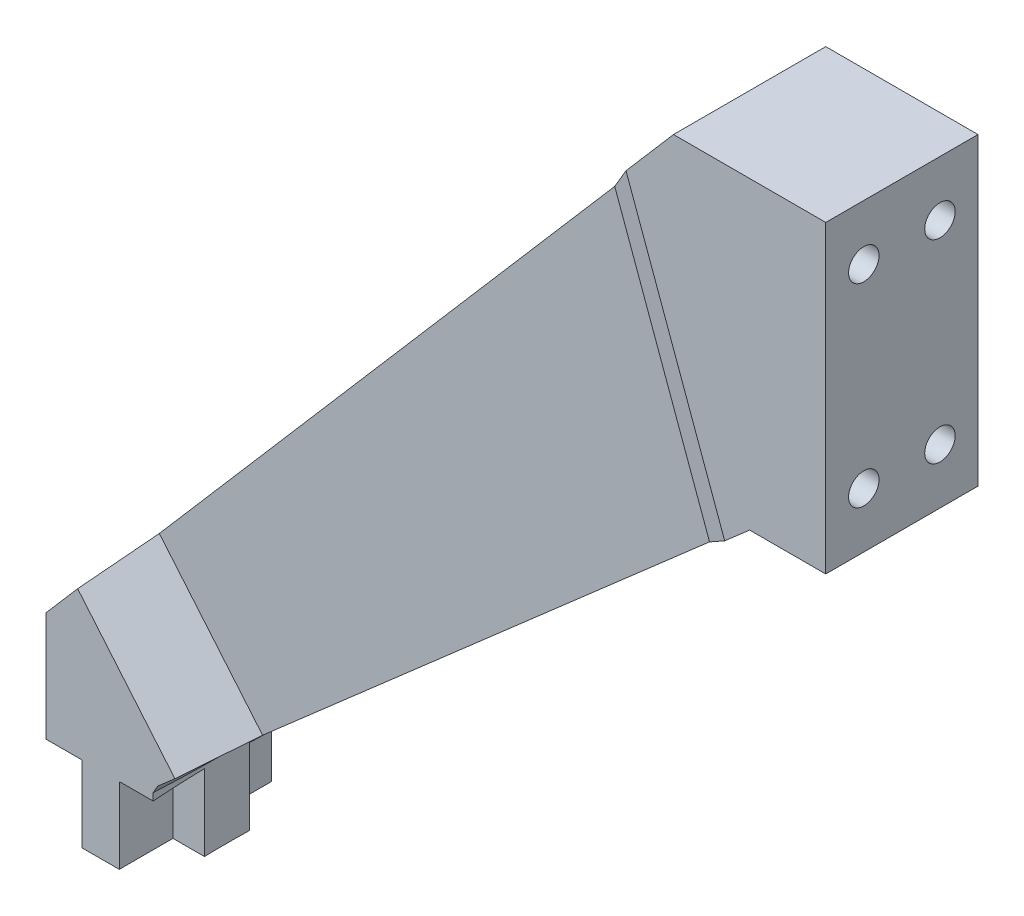
ISO-10303-21;
HEADER;
FILE_DESCRIPTION(('STEP AP214'),'2;1');
FILE_NAME('part.step','',(''),(''),'','','');
FILE_SCHEMA(('AUTOMOTIVE_DESIGN { 1 0 10303 214 1 1 1 1 }'));
ENDSEC;
DATA;
#1=APPLICATION_CONTEXT('core data for automotive mechanical design processes');
#2=APPLICATION_PROTOCOL_DEFINITION('international standard','automotive_design',2000,#1);
#3=PRODUCT_CONTEXT('',#1,'mechanical');
#4=PRODUCT('Part','Part','',(#3));
#5=PRODUCT_RELATED_PRODUCT_CATEGORY('part','',(#4));
#6=PRODUCT_DEFINITION_FORMATION('','',#4);
#7=PRODUCT_DEFINITION_CONTEXT('part definition',#1,'design');
#8=PRODUCT_DEFINITION('design','',#6,#7);
#9=PRODUCT_DEFINITION_SHAPE('','',#8);
#10=(LENGTH_UNIT() NAMED_UNIT(*) SI_UNIT(.MILLI.,.METRE.));
#11=(NAMED_UNIT(*) PLANE_ANGLE_UNIT() SI_UNIT($,.RADIAN.));
#12=(NAMED_UNIT(*) SI_UNIT($,.STERADIAN.) SOLID_ANGLE_UNIT());
#13=UNCERTAINTY_MEASURE_WITH_UNIT(LENGTH_MEASURE(1.E-05),#10,'distance_accuracy_value','');
#14=(GEOMETRIC_REPRESENTATION_CONTEXT(3) GLOBAL_UNCERTAINTY_ASSIGNED_CONTEXT((#13)) GLOBAL_UNIT_ASSIGNED_CONTEXT((#10,
#11,#12)) REPRESENTATION_CONTEXT('',''));
#15=CARTESIAN_POINT('',(0.,0.,0.));
#16=DIRECTION('',(0.,0.,1.));
#17=DIRECTION('',(1.,0.,0.));
#18=AXIS2_PLACEMENT_3D('',#15,#16,#17);
#19=CARTESIAN_POINT('',(-102.75,24.,10.));
#20=DIRECTION('',(0.757443598204121,-0.652900601576989,0.));
#21=DIRECTION('',(0.652900601576989,0.757443598204121,0.));
#22=AXIS2_PLACEMENT_3D('',#19,#20,#21);
#23=PLANE('',#22);
#24=CARTESIAN_POINT('',(52.25,203.818731117825,0.));
#25=DIRECTION('',(0.757443598204121,-0.652900601576989,0.));
#26=DIRECTION('',(0.652900601576989,0.757443598204121,0.));
#27=AXIS2_PLACEMENT_3D('',#24,#25,#26);
#28=ELLIPSE('',#27,237.402139966818,155.);
#29=CARTESIAN_POINT('',(-102.42708298258,24.3746227634115,10.));
#30=VERTEX_POINT('',#29);
#31=CARTESIAN_POINT('',(-102.42708298258,24.3746227634115,-10.));
#32=VERTEX_POINT('',#31);
#33=EDGE_CURVE('E433',#30,#32,#28,.T.);
#34=ORIENTED_EDGE('',*,*,#33,.F.);
#35=DIRECTION('',(-0.652900601576989,-0.757443598204121,0.));
#36=VECTOR('',#35,1.);
#37=CARTESIAN_POINT('',(-102.75,24.,10.));
#38=LINE('',#37,#36);
#39=CARTESIAN_POINT('',(-98.2695065130106,29.1979138942717,10.));
#40=VERTEX_POINT('',#39);
#41=EDGE_CURVE('E415',#40,#30,#38,.T.);
#42=ORIENTED_EDGE('',*,*,#41,.F.);
#43=DIRECTION('',(-0.567259398931517,-0.658089453745325,0.495111144282809));
#44=VECTOR('',#43,1.);
#45=CARTESIAN_POINT('',(-101.65167402658,25.2741908573818,12.9519983819634));
#46=LINE('',#45,#44);
#47=CARTESIAN_POINT('',(-92.5408998609303,35.8437898894344,5.));
#48=VERTEX_POINT('',#47);
#49=EDGE_CURVE('E299',#40,#48,#46,.F.);
#50=ORIENTED_EDGE('',*,*,#49,.T.);
#51=DIRECTION('',(-0.652900601576989,-0.757443598204121,0.));
#52=VECTOR('',#51,1.);
#53=CARTESIAN_POINT('',(-70.8186618005813,61.0442110833136,5.));
#54=LINE('',#53,#52);
#55=CARTESIAN_POINT('',(-32.7202666450974,105.242953499343,5.));
#56=VERTEX_POINT('',#55);
#57=EDGE_CURVE('E389',#56,#48,#54,.T.);
#58=ORIENTED_EDGE('',*,*,#57,.F.);
#59=DIRECTION('',(0.583085827464092,0.676450023402452,0.449918085488167));
#60=VECTOR('',#59,1.);
#61=CARTESIAN_POINT('',(-87.2624370361734,41.9674446468562,-37.0855862462777));
#62=LINE('',#61,#60);
#63=CARTESIAN_POINT('',(-26.2403556760659,112.760433294232,10.));
#64=VERTEX_POINT('',#63);
#65=EDGE_CURVE('E288',#56,#64,#62,.T.);
#66=ORIENTED_EDGE('',*,*,#65,.T.);
#67=CARTESIAN_POINT('',(-20.,120.,10.));
#68=VERTEX_POINT('',#67);
#69=EDGE_CURVE('E416',#68,#64,#38,.T.);
#70=ORIENTED_EDGE('',*,*,#69,.F.);
#71=DIRECTION('',(0.,0.,-1.));
#72=VECTOR('',#71,1.);
#73=CARTESIAN_POINT('',(-20.,120.,10.));
#74=LINE('',#73,#72);
#75=CARTESIAN_POINT('',(-20.,120.,-10.));
#76=VERTEX_POINT('',#75);
#77=EDGE_CURVE('E253',#68,#76,#74,.T.);
#78=ORIENTED_EDGE('',*,*,#77,.T.);
#79=DIRECTION('',(-0.652900601576989,-0.757443598204121,0.));
#80=VECTOR('',#79,1.);
#81=CARTESIAN_POINT('',(-102.75,24.,-10.));
#82=LINE('',#81,#80);
#83=CARTESIAN_POINT('',(-26.2403556760659,112.760433294232,-10.));
#84=VERTEX_POINT('',#83);
#85=EDGE_CURVE('E428',#76,#84,#82,.T.);
#86=ORIENTED_EDGE('',*,*,#85,.T.);
#87=DIRECTION('',(0.583085827464092,0.676450023402452,-0.449918085488167));
#88=VECTOR('',#87,1.);
#89=CARTESIAN_POINT('',(-92.509254219532,35.8805026577031,41.1341119192644));
#90=LINE('',#89,#88);
#91=CARTESIAN_POINT('',(-32.7202666450974,105.242953499343,-5.));
#92=VERTEX_POINT('',#91);
#93=EDGE_CURVE('E312',#84,#92,#90,.F.);
#94=ORIENTED_EDGE('',*,*,#93,.T.);
#95=DIRECTION('',(-0.652900601576989,-0.757443598204121,0.));
#96=VECTOR('',#95,1.);
#97=CARTESIAN_POINT('',(-70.8186618005813,61.0442110833136,-5.));
#98=LINE('',#97,#96);
#99=CARTESIAN_POINT('',(-92.5408998609303,35.8437898894344,-5.));
#100=VERTEX_POINT('',#99);
#101=EDGE_CURVE('E473',#92,#100,#98,.T.);
#102=ORIENTED_EDGE('',*,*,#101,.T.);
#103=DIRECTION('',(-0.567259398931517,-0.658089453745325,-0.495111144282809));
#104=VECTOR('',#103,1.);
#105=CARTESIAN_POINT('',(-96.0345450243765,31.7907393070677,-8.04929747810276));
#106=LINE('',#105,#104);
#107=CARTESIAN_POINT('',(-98.2695065130106,29.1979138942717,-10.));
#108=VERTEX_POINT('',#107);
#109=EDGE_CURVE('E317',#100,#108,#106,.T.);
#110=ORIENTED_EDGE('',*,*,#109,.T.);
#111=EDGE_CURVE('E427',#108,#32,#82,.T.);
#112=ORIENTED_EDGE('',*,*,#111,.T.);
#113=EDGE_LOOP('',(#34,#42,#50,#58,#66,#70,#78,#86,#94,#102,#110,#112));
#114=FACE_BOUND('',#113,.T.);
#115=ADVANCED_FACE('F43',(#114),#23,.F.);
#116=CARTESIAN_POINT('',(0.,0.,10.));
#117=DIRECTION('',(0.,0.,-1.));
#118=DIRECTION('',(-1.,0.,0.));
#119=AXIS2_PLACEMENT_3D('',#116,#117,#118);
#120=PLANE('',#119);
#121=DIRECTION('',(0.,-1.,0.));
#122=VECTOR('',#121,1.);
#123=CARTESIAN_POINT('',(-88.3546420416717,12.,10.));
#124=LINE('',#123,#122);
#125=CARTESIAN_POINT('',(-88.3546420416717,9.99999999999999,10.));
#126=VERTEX_POINT('',#125);
#127=CARTESIAN_POINT('',(-88.3546420416717,10.9527292634325,10.));
#128=VERTEX_POINT('',#127);
#129=EDGE_CURVE('E58',#126,#128,#124,.F.);
#130=ORIENTED_EDGE('',*,*,#129,.T.);
#131=DIRECTION('',(0.500000000000007,0.866025403784435,0.));
#132=VECTOR('',#131,1.);
#133=CARTESIAN_POINT('',(-87.75,12.,10.));
#134=LINE('',#133,#132);
#135=CARTESIAN_POINT('',(-87.75,12.,10.));
#136=VERTEX_POINT('',#135);
#137=EDGE_CURVE('E244',#128,#136,#134,.T.);
#138=ORIENTED_EDGE('',*,*,#137,.T.);
#139=DIRECTION('',(0.752726607938879,0.658333239097669,0.));
#140=VECTOR('',#139,1.);
#141=CARTESIAN_POINT('',(-87.75,12.,10.));
#142=LINE('',#141,#140);
#143=CARTESIAN_POINT('',(-85.4942105824559,13.9729090725787,10.));
#144=VERTEX_POINT('',#143);
#145=EDGE_CURVE('E252',#136,#144,#142,.T.);
#146=ORIENTED_EDGE('',*,*,#145,.T.);
#147=DIRECTION('',(0.642787609686533,-0.766044443118983,0.));
#148=VECTOR('',#147,1.);
#149=CARTESIAN_POINT('',(-43.2897476321817,-36.3244112719206,10.));
#150=LINE('',#149,#148);
#151=EDGE_CURVE('E296',#144,#40,#150,.F.);
#152=ORIENTED_EDGE('',*,*,#151,.T.);
#153=ORIENTED_EDGE('',*,*,#41,.T.);
#154=DIRECTION('',(0.,1.,0.));
#155=VECTOR('',#154,1.);
#156=CARTESIAN_POINT('',(-102.42708298258,0.,10.));
#157=LINE('',#156,#155);
#158=CARTESIAN_POINT('',(-102.42708298258,9.99999999999999,10.));
#159=VERTEX_POINT('',#158);
#160=EDGE_CURVE('E506',#159,#30,#157,.T.);
#161=ORIENTED_EDGE('',*,*,#160,.F.);
#162=DIRECTION('',(-1.,0.,0.));
#163=VECTOR('',#162,1.);
#164=CARTESIAN_POINT('',(0.,10.,10.));
#165=LINE('',#164,#163);
#166=CARTESIAN_POINT('',(-97.7,9.99999999999999,10.));
#167=VERTEX_POINT('',#166);
#168=EDGE_CURVE('E400',#167,#159,#165,.T.);
#169=ORIENTED_EDGE('',*,*,#168,.F.);
#170=DIRECTION('',(0.,-1.,0.));
#171=VECTOR('',#170,1.);
#172=CARTESIAN_POINT('',(-97.7,9.99999999999999,10.));
#173=LINE('',#172,#171);
#174=CARTESIAN_POINT('',(-97.7,0.,10.));
#175=VERTEX_POINT('',#174);
#176=EDGE_CURVE('E408',#167,#175,#173,.T.);
#177=ORIENTED_EDGE('',*,*,#176,.T.);
#178=DIRECTION('',(1.,0.,0.));
#179=VECTOR('',#178,1.);
#180=CARTESIAN_POINT('',(-87.75,0.,10.));
#181=LINE('',#180,#179);
#182=CARTESIAN_POINT('',(-92.8,0.,10.));
#183=VERTEX_POINT('',#182);
#184=EDGE_CURVE('E418',#175,#183,#181,.T.);
#185=ORIENTED_EDGE('',*,*,#184,.T.);
#186=DIRECTION('',(0.,-1.,0.));
#187=VECTOR('',#186,1.);
#188=CARTESIAN_POINT('',(-92.8,9.99999999999999,10.));
#189=LINE('',#188,#187);
#190=CARTESIAN_POINT('',(-92.8,9.99999999999999,10.));
#191=VERTEX_POINT('',#190);
#192=EDGE_CURVE('E344',#191,#183,#189,.T.);
#193=ORIENTED_EDGE('',*,*,#192,.F.);
#194=DIRECTION('',(-1.,0.,0.));
#195=VECTOR('',#194,1.);
#196=CARTESIAN_POINT('',(0.,10.,10.));
#197=LINE('',#196,#195);
#198=EDGE_CURVE('E348',#126,#191,#197,.T.);
#199=ORIENTED_EDGE('',*,*,#198,.F.);
#200=EDGE_LOOP('',(#130,#138,#146,#152,#153,#161,#169,#177,#185,#193,#199));
#201=FACE_BOUND('',#200,.T.);
#202=ADVANCED_FACE('F484',(#201),#120,.F.);
#203=CARTESIAN_POINT('',(-87.75,0.,10.));
#204=DIRECTION('',(0.,1.,0.));
#205=DIRECTION('',(-1.,0.,0.));
#206=AXIS2_PLACEMENT_3D('',#203,#204,#205);
#207=PLANE('',#206);
#208=DIRECTION('',(-1.,0.,0.));
#209=VECTOR('',#208,1.);
#210=CARTESIAN_POINT('',(0.,0.,-2.94999999999999));
#211=LINE('',#210,#209);
#212=CARTESIAN_POINT('',(-88.6699779188501,0.,-2.95));
#213=VERTEX_POINT('',#212);
#214=CARTESIAN_POINT('',(-92.8,0.,-2.95));
#215=VERTEX_POINT('',#214);
#216=EDGE_CURVE('E368',#213,#215,#211,.T.);
#217=ORIENTED_EDGE('',*,*,#216,.F.);
#218=CARTESIAN_POINT('',(56.25,0.,0.));
#219=DIRECTION('',(0.,-1.,0.));
#220=DIRECTION('',(1.,0.,0.));
#221=AXIS2_PLACEMENT_3D('',#218,#219,#220);
#222=CIRCLE('',#221,144.95);
#223=CARTESIAN_POINT('',(-88.6699779188501,0.,2.95));
#224=VERTEX_POINT('',#223);
#225=EDGE_CURVE('E338',#224,#213,#222,.T.);
#226=ORIENTED_EDGE('',*,*,#225,.F.);
#227=DIRECTION('',(-1.,0.,0.));
#228=VECTOR('',#227,1.);
#229=CARTESIAN_POINT('',(0.,0.,2.95000000000001));
#230=LINE('',#229,#228);
#231=CARTESIAN_POINT('',(-92.8,0.,2.94999999999999));
#232=VERTEX_POINT('',#231);
#233=EDGE_CURVE('E337',#224,#232,#230,.T.);
#234=ORIENTED_EDGE('',*,*,#233,.T.);
#235=DIRECTION('',(0.,0.,-1.));
#236=VECTOR('',#235,1.);
#237=CARTESIAN_POINT('',(-92.8,0.,0.));
#238=LINE('',#237,#236);
#239=EDGE_CURVE('E352',#183,#232,#238,.T.);
#240=ORIENTED_EDGE('',*,*,#239,.F.);
#241=ORIENTED_EDGE('',*,*,#184,.F.);
#242=DIRECTION('',(0.,0.,-1.));
#243=VECTOR('',#242,1.);
#244=CARTESIAN_POINT('',(-97.7,0.,0.));
#245=LINE('',#244,#243);
#246=CARTESIAN_POINT('',(-97.7,0.,2.94999999999999));
#247=VERTEX_POINT('',#246);
#248=EDGE_CURVE('E398',#175,#247,#245,.T.);
#249=ORIENTED_EDGE('',*,*,#248,.T.);
#250=DIRECTION('',(-1.,0.,0.));
#251=VECTOR('',#250,1.);
#252=CARTESIAN_POINT('',(0.,0.,2.95000000000001));
#253=LINE('',#252,#251);
#254=CARTESIAN_POINT('',(-102.721924876734,0.,2.94999999999999));
#255=VERTEX_POINT('',#254);
#256=EDGE_CURVE('E357',#247,#255,#253,.T.);
#257=ORIENTED_EDGE('',*,*,#256,.T.);
#258=CARTESIAN_POINT('',(52.25,0.,0.));
#259=DIRECTION('',(0.,1.,0.));
#260=DIRECTION('',(0.,0.,1.));
#261=AXIS2_PLACEMENT_3D('',#258,#259,#260);
#262=CIRCLE('',#261,155.);
#263=CARTESIAN_POINT('',(-102.721924876734,0.,-2.95));
#264=VERTEX_POINT('',#263);
#265=EDGE_CURVE('E503',#264,#255,#262,.T.);
#266=ORIENTED_EDGE('',*,*,#265,.F.);
#267=DIRECTION('',(-1.,0.,0.));
#268=VECTOR('',#267,1.);
#269=CARTESIAN_POINT('',(0.,0.,-2.94999999999999));
#270=LINE('',#269,#268);
#271=CARTESIAN_POINT('',(-97.7,0.,-2.95));
#272=VERTEX_POINT('',#271);
#273=EDGE_CURVE('E380',#272,#264,#270,.T.);
#274=ORIENTED_EDGE('',*,*,#273,.F.);
#275=DIRECTION('',(0.,0.,-1.));
#276=VECTOR('',#275,1.);
#277=CARTESIAN_POINT('',(-97.7,0.,0.));
#278=LINE('',#277,#276);
#279=CARTESIAN_POINT('',(-97.7,0.,-10.));
#280=VERTEX_POINT('',#279);
#281=EDGE_CURVE('E386',#272,#280,#278,.T.);
#282=ORIENTED_EDGE('',*,*,#281,.T.);
#283=DIRECTION('',(1.,0.,0.));
#284=VECTOR('',#283,1.);
#285=CARTESIAN_POINT('',(-87.75,0.,-10.));
#286=LINE('',#285,#284);
#287=CARTESIAN_POINT('',(-92.8,0.,-10.));
#288=VERTEX_POINT('',#287);
#289=EDGE_CURVE('E265',#280,#288,#286,.T.);
#290=ORIENTED_EDGE('',*,*,#289,.T.);
#291=DIRECTION('',(0.,0.,-1.));
#292=VECTOR('',#291,1.);
#293=CARTESIAN_POINT('',(-92.8,0.,0.));
#294=LINE('',#293,#292);
#295=EDGE_CURVE('E362',#215,#288,#294,.T.);
#296=ORIENTED_EDGE('',*,*,#295,.F.);
#297=EDGE_LOOP('',(#217,#226,#234,#240,#241,#249,#257,#266,#274,#282,#290,#296));
#298=FACE_BOUND('',#297,.T.);
#299=ADVANCED_FACE('F490',(#298),#207,.F.);
#300=CARTESIAN_POINT('',(0.,0.,-10.));
#301=DIRECTION('',(0.,0.,-1.));
#302=DIRECTION('',(-1.,0.,0.));
#303=AXIS2_PLACEMENT_3D('',#300,#301,#302);
#304=PLANE('',#303);
#305=DIRECTION('',(-0.500000000000007,-0.866025403784434,0.));
#306=VECTOR('',#305,1.);
#307=CARTESIAN_POINT('',(-87.75,12.,-10.));
#308=LINE('',#307,#306);
#309=CARTESIAN_POINT('',(-87.75,12.,-10.));
#310=VERTEX_POINT('',#309);
#311=CARTESIAN_POINT('',(-88.3546420416717,10.9527292634325,-10.));
#312=VERTEX_POINT('',#311);
#313=EDGE_CURVE('E235',#310,#312,#308,.T.);
#314=ORIENTED_EDGE('',*,*,#313,.T.);
#315=DIRECTION('',(0.,-1.,0.));
#316=VECTOR('',#315,1.);
#317=CARTESIAN_POINT('',(-88.3546420416717,12.,-10.));
#318=LINE('',#317,#316);
#319=CARTESIAN_POINT('',(-88.3546420416717,9.99999999999999,-10.));
#320=VERTEX_POINT('',#319);
#321=EDGE_CURVE('E501',#320,#312,#318,.F.);
#322=ORIENTED_EDGE('',*,*,#321,.F.);
#323=DIRECTION('',(1.,0.,0.));
#324=VECTOR('',#323,1.);
#325=CARTESIAN_POINT('',(0.,10.,-10.));
#326=LINE('',#325,#324);
#327=CARTESIAN_POINT('',(-92.8,9.99999999999999,-10.));
#328=VERTEX_POINT('',#327);
#329=EDGE_CURVE('E364',#328,#320,#326,.T.);
#330=ORIENTED_EDGE('',*,*,#329,.F.);
#331=DIRECTION('',(0.,-1.,0.));
#332=VECTOR('',#331,1.);
#333=CARTESIAN_POINT('',(-92.8,9.99999999999999,-10.));
#334=LINE('',#333,#332);
#335=EDGE_CURVE('E355',#328,#288,#334,.T.);
#336=ORIENTED_EDGE('',*,*,#335,.T.);
#337=ORIENTED_EDGE('',*,*,#289,.F.);
#338=DIRECTION('',(0.,-1.,0.));
#339=VECTOR('',#338,1.);
#340=CARTESIAN_POINT('',(-97.7,9.99999999999999,-10.));
#341=LINE('',#340,#339);
#342=CARTESIAN_POINT('',(-97.7,9.99999999999999,-10.));
#343=VERTEX_POINT('',#342);
#344=EDGE_CURVE('E370',#343,#280,#341,.T.);
#345=ORIENTED_EDGE('',*,*,#344,.F.);
#346=DIRECTION('',(1.,0.,0.));
#347=VECTOR('',#346,1.);
#348=CARTESIAN_POINT('',(0.,10.,-10.));
#349=LINE('',#348,#347);
#350=CARTESIAN_POINT('',(-102.42708298258,9.99999999999999,-10.));
#351=VERTEX_POINT('',#350);
#352=EDGE_CURVE('E383',#351,#343,#349,.T.);
#353=ORIENTED_EDGE('',*,*,#352,.F.);
#354=DIRECTION('',(0.,1.,0.));
#355=VECTOR('',#354,1.);
#356=CARTESIAN_POINT('',(-102.42708298258,0.,-10.));
#357=LINE('',#356,#355);
#358=EDGE_CURVE('E438',#351,#32,#357,.T.);
#359=ORIENTED_EDGE('',*,*,#358,.T.);
#360=ORIENTED_EDGE('',*,*,#111,.F.);
#361=DIRECTION('',(0.642787609686533,-0.766044443118983,0.));
#362=VECTOR('',#361,1.);
#363=CARTESIAN_POINT('',(-43.2897476321817,-36.3244112719206,-10.));
#364=LINE('',#363,#362);
#365=CARTESIAN_POINT('',(-85.4942105824559,13.9729090725787,-10.));
#366=VERTEX_POINT('',#365);
#367=EDGE_CURVE('E258',#108,#366,#364,.T.);
#368=ORIENTED_EDGE('',*,*,#367,.T.);
#369=DIRECTION('',(0.752726607938879,0.658333239097669,0.));
#370=VECTOR('',#369,1.);
#371=CARTESIAN_POINT('',(-87.75,12.,-10.));
#372=LINE('',#371,#370);
#373=EDGE_CURVE('E249',#310,#366,#372,.T.);
#374=ORIENTED_EDGE('',*,*,#373,.F.);
#375=EDGE_LOOP('',(#314,#322,#330,#336,#337,#345,#353,#359,#360,#368,#374));
#376=FACE_BOUND('',#375,.T.);
#377=ADVANCED_FACE('F256',(#376),#304,.T.);
#378=CARTESIAN_POINT('',(0.,10.,-2.94999999999999));
#379=DIRECTION('',(0.,0.,1.));
#380=DIRECTION('',(1.,0.,0.));
#381=AXIS2_PLACEMENT_3D('',#378,#379,#380);
#382=PLANE('',#381);
#383=DIRECTION('',(0.,1.,0.));
#384=VECTOR('',#383,1.);
#385=CARTESIAN_POINT('',(-102.721924876734,0.,-2.95));
#386=LINE('',#385,#384);
#387=CARTESIAN_POINT('',(-102.721924876734,9.99999999999999,-2.95));
#388=VERTEX_POINT('',#387);
#389=EDGE_CURVE('E442',#388,#264,#386,.F.);
#390=ORIENTED_EDGE('',*,*,#389,.F.);
#391=DIRECTION('',(-1.,0.,0.));
#392=VECTOR('',#391,1.);
#393=CARTESIAN_POINT('',(0.,10.,-2.94999999999999));
#394=LINE('',#393,#392);
#395=CARTESIAN_POINT('',(-97.7,9.99999999999999,-2.95));
#396=VERTEX_POINT('',#395);
#397=EDGE_CURVE('E379',#396,#388,#394,.T.);
#398=ORIENTED_EDGE('',*,*,#397,.F.);
#399=DIRECTION('',(0.,-1.,0.));
#400=VECTOR('',#399,1.);
#401=CARTESIAN_POINT('',(-97.7,9.99999999999999,-2.95));
#402=LINE('',#401,#400);
#403=EDGE_CURVE('E385',#396,#272,#402,.T.);
#404=ORIENTED_EDGE('',*,*,#403,.T.);
#405=ORIENTED_EDGE('',*,*,#273,.T.);
#406=EDGE_LOOP('',(#390,#398,#404,#405));
#407=FACE_BOUND('',#406,.T.);
#408=ADVANCED_FACE('F516',(#407),#382,.F.);
#409=CARTESIAN_POINT('',(0.,10.,0.));
#410=DIRECTION('',(0.,-1.,0.));
#411=DIRECTION('',(1.,0.,0.));
#412=AXIS2_PLACEMENT_3D('',#409,#410,#411);
#413=PLANE('',#412);
#414=ORIENTED_EDGE('',*,*,#397,.T.);
#415=CARTESIAN_POINT('',(52.25,10.,0.));
#416=DIRECTION('',(0.,-1.,0.));
#417=DIRECTION('',(1.,0.,0.));
#418=AXIS2_PLACEMENT_3D('',#415,#416,#417);
#419=CIRCLE('',#418,155.);
#420=EDGE_CURVE('E447',#388,#351,#419,.T.);
#421=ORIENTED_EDGE('',*,*,#420,.T.);
#422=ORIENTED_EDGE('',*,*,#352,.T.);
#423=DIRECTION('',(0.,0.,-1.));
#424=VECTOR('',#423,1.);
#425=CARTESIAN_POINT('',(-97.7,9.99999999999999,0.));
#426=LINE('',#425,#424);
#427=EDGE_CURVE('E376',#396,#343,#426,.T.);
#428=ORIENTED_EDGE('',*,*,#427,.F.);
#429=EDGE_LOOP('',(#414,#421,#422,#428));
#430=FACE_BOUND('',#429,.T.);
#431=ADVANCED_FACE('F509',(#430),#413,.T.);
#432=CARTESIAN_POINT('',(0.,10.,2.95000000000001));
#433=DIRECTION('',(0.,0.,1.));
#434=DIRECTION('',(1.,0.,0.));
#435=AXIS2_PLACEMENT_3D('',#432,#433,#434);
#436=PLANE('',#435);
#437=DIRECTION('',(-1.,0.,0.));
#438=VECTOR('',#437,1.);
#439=CARTESIAN_POINT('',(0.,10.,2.95000000000001));
#440=LINE('',#439,#438);
#441=CARTESIAN_POINT('',(-97.7,9.99999999999999,2.94999999999999));
#442=VERTEX_POINT('',#441);
#443=CARTESIAN_POINT('',(-102.721924876734,9.99999999999999,2.94999999999999));
#444=VERTEX_POINT('',#443);
#445=EDGE_CURVE('E394',#442,#444,#440,.T.);
#446=ORIENTED_EDGE('',*,*,#445,.T.);
#447=DIRECTION('',(0.,1.,0.));
#448=VECTOR('',#447,1.);
#449=CARTESIAN_POINT('',(-102.721924876734,0.,2.94999999999999));
#450=LINE('',#449,#448);
#451=EDGE_CURVE('E66',#444,#255,#450,.F.);
#452=ORIENTED_EDGE('',*,*,#451,.T.);
#453=ORIENTED_EDGE('',*,*,#256,.F.);
#454=DIRECTION('',(0.,-1.,0.));
#455=VECTOR('',#454,1.);
#456=CARTESIAN_POINT('',(-97.7,9.99999999999999,2.94999999999999));
#457=LINE('',#456,#455);
#458=EDGE_CURVE('E403',#442,#247,#457,.T.);
#459=ORIENTED_EDGE('',*,*,#458,.F.);
#460=EDGE_LOOP('',(#446,#452,#453,#459));
#461=FACE_BOUND('',#460,.T.);
#462=ADVANCED_FACE('F522',(#461),#436,.T.);
#463=CARTESIAN_POINT('',(0.,10.,0.));
#464=DIRECTION('',(0.,-1.,0.));
#465=DIRECTION('',(1.,0.,0.));
#466=AXIS2_PLACEMENT_3D('',#463,#464,#465);
#467=PLANE('',#466);
#468=ORIENTED_EDGE('',*,*,#168,.T.);
#469=CARTESIAN_POINT('',(52.25,10.,0.));
#470=DIRECTION('',(0.,-1.,0.));
#471=DIRECTION('',(1.,0.,0.));
#472=AXIS2_PLACEMENT_3D('',#469,#470,#471);
#473=CIRCLE('',#472,155.);
#474=EDGE_CURVE('E323',#159,#444,#473,.T.);
#475=ORIENTED_EDGE('',*,*,#474,.T.);
#476=ORIENTED_EDGE('',*,*,#445,.F.);
#477=DIRECTION('',(0.,0.,-1.));
#478=VECTOR('',#477,1.);
#479=CARTESIAN_POINT('',(-97.7,9.99999999999999,0.));
#480=LINE('',#479,#478);
#481=EDGE_CURVE('E397',#167,#442,#480,.T.);
#482=ORIENTED_EDGE('',*,*,#481,.F.);
#483=EDGE_LOOP('',(#468,#475,#476,#482));
#484=FACE_BOUND('',#483,.T.);
#485=ADVANCED_FACE('F526',(#484),#467,.T.);
#486=CARTESIAN_POINT('',(-87.75,12.,10.));
#487=DIRECTION('',(-0.658333239097669,0.752726607938879,0.));
#488=DIRECTION('',(-0.752726607938879,-0.658333239097669,0.));
#489=AXIS2_PLACEMENT_3D('',#486,#487,#488);
#490=PLANE('',#489);
#491=DIRECTION('',(0.752726607938879,0.658333239097669,0.));
#492=VECTOR('',#491,1.);
#493=CARTESIAN_POINT('',(-43.9776222137606,50.2832371635277,-5.));
#494=LINE('',#493,#492);
#495=CARTESIAN_POINT('',(-78.9740408589725,19.6754369336318,-5.));
#496=VERTEX_POINT('',#495);
#497=CARTESIAN_POINT('',(-20.2649616698235,71.0222843273569,-5.));
#498=VERTEX_POINT('',#497);
#499=EDGE_CURVE('E469',#496,#498,#494,.T.);
#500=ORIENTED_EDGE('',*,*,#499,.T.);
#501=DIRECTION('',(-0.66277764332821,-0.579664048184158,0.474041545380843));
#502=VECTOR('',#501,1.);
#503=CARTESIAN_POINT('',(-77.297835586302,21.1414428312728,35.7918884425767));
#504=LINE('',#503,#502);
#505=CARTESIAN_POINT('',(-13.2742490436154,77.1363481033331,-10.));
#506=VERTEX_POINT('',#505);
#507=EDGE_CURVE('E314',#498,#506,#504,.F.);
#508=ORIENTED_EDGE('',*,*,#507,.T.);
#509=CARTESIAN_POINT('',(-9.99999999999999,80.,-10.));
#510=VERTEX_POINT('',#509);
#511=EDGE_CURVE('E261',#506,#510,#372,.T.);
#512=ORIENTED_EDGE('',*,*,#511,.T.);
#513=DIRECTION('',(0.,0.,-1.));
#514=VECTOR('',#513,1.);
#515=CARTESIAN_POINT('',(-9.99999999999999,80.,10.));
#516=LINE('',#515,#514);
#517=CARTESIAN_POINT('',(-9.99999999999999,80.,10.));
#518=VERTEX_POINT('',#517);
#519=EDGE_CURVE('E254',#518,#510,#516,.T.);
#520=ORIENTED_EDGE('',*,*,#519,.F.);
#521=CARTESIAN_POINT('',(-13.2742490436154,77.1363481033331,10.));
#522=VERTEX_POINT('',#521);
#523=EDGE_CURVE('E421',#522,#518,#142,.T.);
#524=ORIENTED_EDGE('',*,*,#523,.F.);
#525=DIRECTION('',(-0.66277764332821,-0.579664048184158,-0.474041545380843));
#526=VECTOR('',#525,1.);
#527=CARTESIAN_POINT('',(-71.0141528205584,26.6371396553315,-31.2975807076356));
#528=LINE('',#527,#526);
#529=CARTESIAN_POINT('',(-20.2649616698235,71.0222843273569,5.));
#530=VERTEX_POINT('',#529);
#531=EDGE_CURVE('E294',#522,#530,#528,.T.);
#532=ORIENTED_EDGE('',*,*,#531,.T.);
#533=DIRECTION('',(0.752726607938879,0.658333239097669,0.));
#534=VECTOR('',#533,1.);
#535=CARTESIAN_POINT('',(-43.9776222137606,50.2832371635277,5.));
#536=LINE('',#535,#534);
#537=CARTESIAN_POINT('',(-78.9740408589725,19.6754369336318,5.));
#538=VERTEX_POINT('',#537);
#539=EDGE_CURVE('E475',#538,#530,#536,.T.);
#540=ORIENTED_EDGE('',*,*,#539,.F.);
#541=DIRECTION('',(0.651914508471827,0.570163171396581,-0.49992142545297));
#542=VECTOR('',#541,1.);
#543=CARTESIAN_POINT('',(-87.1862298793185,12.4930722598886,11.2975270342799));
#544=LINE('',#543,#542);
#545=EDGE_CURVE('E301',#538,#144,#544,.F.);
#546=ORIENTED_EDGE('',*,*,#545,.T.);
#547=ORIENTED_EDGE('',*,*,#145,.F.);
#548=DIRECTION('',(0.,0.,-1.));
#549=VECTOR('',#548,1.);
#550=CARTESIAN_POINT('',(-87.75,12.,10.));
#551=LINE('',#550,#549);
#552=EDGE_CURVE('E238',#136,#310,#551,.T.);
#553=ORIENTED_EDGE('',*,*,#552,.T.);
#554=ORIENTED_EDGE('',*,*,#373,.T.);
#555=DIRECTION('',(0.651914508471827,0.570163171396581,0.49992142545297));
#556=VECTOR('',#555,1.);
#557=CARTESIAN_POINT('',(-80.6681092723443,18.1938079675959,-6.2990984017413));
#558=LINE('',#557,#556);
#559=EDGE_CURVE('E321',#366,#496,#558,.T.);
#560=ORIENTED_EDGE('',*,*,#559,.T.);
#561=EDGE_LOOP('',(#500,#508,#512,#520,#524,#532,#540,#546,#547,#553,#554,#560));
#562=FACE_BOUND('',#561,.T.);
#563=ADVANCED_FACE('F248',(#562),#490,.F.);
#564=ORIENTED_EDGE('',*,*,#511,.F.);
#565=DIRECTION('',(0.342020143325666,-0.939692620785909,0.));
#566=VECTOR('',#565,1.);
#567=CARTESIAN_POINT('',(13.0696875286177,4.75697723157701,-10.));
#568=LINE('',#567,#566);
#569=EDGE_CURVE('E309',#506,#84,#568,.F.);
#570=ORIENTED_EDGE('',*,*,#569,.T.);
#571=ORIENTED_EDGE('',*,*,#85,.F.);
#572=DIRECTION('',(-1.,0.,0.));
#573=VECTOR('',#572,1.);
#574=CARTESIAN_POINT('',(0.,120.,-10.));
#575=LINE('',#574,#573);
#576=CARTESIAN_POINT('',(0.,120.,-10.));
#577=VERTEX_POINT('',#576);
#578=EDGE_CURVE('E411',#577,#76,#575,.T.);
#579=ORIENTED_EDGE('',*,*,#578,.F.);
#580=DIRECTION('',(0.,1.,0.));
#581=VECTOR('',#580,1.);
#582=CARTESIAN_POINT('',(0.,120.,-10.));
#583=LINE('',#582,#581);
#584=CARTESIAN_POINT('',(0.,80.,-10.));
#585=VERTEX_POINT('',#584);
#586=EDGE_CURVE('E263',#585,#577,#583,.T.);
#587=ORIENTED_EDGE('',*,*,#586,.F.);
#588=DIRECTION('',(1.,0.,0.));
#589=VECTOR('',#588,1.);
#590=CARTESIAN_POINT('',(0.,80.,-10.));
#591=LINE('',#590,#589);
#592=EDGE_CURVE('E260',#510,#585,#591,.T.);
#593=ORIENTED_EDGE('',*,*,#592,.F.);
#594=EDGE_LOOP('',(#564,#570,#571,#579,#587,#593));
#595=FACE_BOUND('',#594,.T.);
#596=ADVANCED_FACE('F553',(#595),#304,.T.);
#597=ORIENTED_EDGE('',*,*,#69,.T.);
#598=DIRECTION('',(0.342020143325666,-0.939692620785909,0.));
#599=VECTOR('',#598,1.);
#600=CARTESIAN_POINT('',(13.0696875286177,4.75697723157701,10.));
#601=LINE('',#600,#599);
#602=EDGE_CURVE('E291',#64,#522,#601,.T.);
#603=ORIENTED_EDGE('',*,*,#602,.T.);
#604=ORIENTED_EDGE('',*,*,#523,.T.);
#605=DIRECTION('',(1.,0.,0.));
#606=VECTOR('',#605,1.);
#607=CARTESIAN_POINT('',(0.,80.,10.));
#608=LINE('',#607,#606);
#609=CARTESIAN_POINT('',(0.,80.,10.));
#610=VERTEX_POINT('',#609);
#611=EDGE_CURVE('E423',#518,#610,#608,.T.);
#612=ORIENTED_EDGE('',*,*,#611,.T.);
#613=DIRECTION('',(0.,1.,0.));
#614=VECTOR('',#613,1.);
#615=CARTESIAN_POINT('',(0.,120.,10.));
#616=LINE('',#615,#614);
#617=CARTESIAN_POINT('',(0.,120.,10.));
#618=VERTEX_POINT('',#617);
#619=EDGE_CURVE('E275',#610,#618,#616,.T.);
#620=ORIENTED_EDGE('',*,*,#619,.T.);
#621=DIRECTION('',(-1.,0.,0.));
#622=VECTOR('',#621,1.);
#623=CARTESIAN_POINT('',(0.,120.,10.));
#624=LINE('',#623,#622);
#625=EDGE_CURVE('E270',#618,#68,#624,.T.);
#626=ORIENTED_EDGE('',*,*,#625,.T.);
#627=EDGE_LOOP('',(#597,#603,#604,#612,#620,#626));
#628=FACE_BOUND('',#627,.T.);
#629=ADVANCED_FACE('F545',(#628),#120,.F.);
#630=CARTESIAN_POINT('',(0.,120.,10.));
#631=DIRECTION('',(0.,-1.,0.));
#632=DIRECTION('',(0.,0.,-1.));
#633=AXIS2_PLACEMENT_3D('',#630,#631,#632);
#634=PLANE('',#633);
#635=ORIENTED_EDGE('',*,*,#578,.T.);
#636=ORIENTED_EDGE('',*,*,#77,.F.);
#637=ORIENTED_EDGE('',*,*,#625,.F.);
#638=DIRECTION('',(0.,0.,-1.));
#639=VECTOR('',#638,1.);
#640=CARTESIAN_POINT('',(0.,120.,10.));
#641=LINE('',#640,#639);
#642=EDGE_CURVE('E271',#618,#577,#641,.T.);
#643=ORIENTED_EDGE('',*,*,#642,.T.);
#644=EDGE_LOOP('',(#635,#636,#637,#643));
#645=FACE_BOUND('',#644,.T.);
#646=ADVANCED_FACE('F549',(#645),#634,.F.);
#647=CARTESIAN_POINT('',(0.,80.,10.));
#648=DIRECTION('',(0.,1.,0.));
#649=DIRECTION('',(0.,0.,1.));
#650=AXIS2_PLACEMENT_3D('',#647,#648,#649);
#651=PLANE('',#650);
#652=ORIENTED_EDGE('',*,*,#592,.T.);
#653=DIRECTION('',(0.,0.,-1.));
#654=VECTOR('',#653,1.);
#655=CARTESIAN_POINT('',(0.,80.,10.));
#656=LINE('',#655,#654);
#657=EDGE_CURVE('E274',#610,#585,#656,.T.);
#658=ORIENTED_EDGE('',*,*,#657,.F.);
#659=ORIENTED_EDGE('',*,*,#611,.F.);
#660=ORIENTED_EDGE('',*,*,#519,.T.);
#661=EDGE_LOOP('',(#652,#658,#659,#660));
#662=FACE_BOUND('',#661,.T.);
#663=ADVANCED_FACE('F569',(#662),#651,.F.);
#664=CARTESIAN_POINT('',(0.,120.,10.));
#665=DIRECTION('',(-1.,0.,0.));
#666=DIRECTION('',(0.,0.,1.));
#667=AXIS2_PLACEMENT_3D('',#664,#665,#666);
#668=PLANE('',#667);
#669=CARTESIAN_POINT('',(0.,112.75,-5.));
#670=DIRECTION('',(1.,0.,0.));
#671=DIRECTION('',(0.,0.,1.));
#672=AXIS2_PLACEMENT_3D('',#669,#670,#671);
#673=CIRCLE('',#672,2.);
#674=CARTESIAN_POINT('',(0.,112.75,-3.));
#675=VERTEX_POINT('',#674);
#676=EDGE_CURVE('E445',#675,#675,#673,.T.);
#677=ORIENTED_EDGE('',*,*,#676,.F.);
#678=EDGE_LOOP('',(#677));
#679=FACE_BOUND('',#678,.T.);
#680=CARTESIAN_POINT('',(0.,87.25,-5.));
#681=DIRECTION('',(1.,0.,0.));
#682=DIRECTION('',(0.,0.,1.));
#683=AXIS2_PLACEMENT_3D('',#680,#681,#682);
#684=CIRCLE('',#683,2.);
#685=CARTESIAN_POINT('',(0.,87.25,-3.));
#686=VERTEX_POINT('',#685);
#687=EDGE_CURVE('E458',#686,#686,#684,.T.);
#688=ORIENTED_EDGE('',*,*,#687,.F.);
#689=EDGE_LOOP('',(#688));
#690=FACE_BOUND('',#689,.T.);
#691=CARTESIAN_POINT('',(0.,87.25,5.));
#692=DIRECTION('',(1.,0.,0.));
#693=DIRECTION('',(0.,0.,-1.));
#694=AXIS2_PLACEMENT_3D('',#691,#692,#693);
#695=CIRCLE('',#694,2.);
#696=CARTESIAN_POINT('',(0.,87.25,3.));
#697=VERTEX_POINT('',#696);
#698=EDGE_CURVE('E451',#697,#697,#695,.T.);
#699=ORIENTED_EDGE('',*,*,#698,.F.);
#700=EDGE_LOOP('',(#699));
#701=FACE_BOUND('',#700,.T.);
#702=CARTESIAN_POINT('',(0.,112.75,5.));
#703=DIRECTION('',(1.,0.,0.));
#704=DIRECTION('',(0.,0.,-1.));
#705=AXIS2_PLACEMENT_3D('',#702,#703,#704);
#706=CIRCLE('',#705,2.);
#707=CARTESIAN_POINT('',(0.,112.75,3.));
#708=VERTEX_POINT('',#707);
#709=EDGE_CURVE('E454',#708,#708,#706,.T.);
#710=ORIENTED_EDGE('',*,*,#709,.F.);
#711=EDGE_LOOP('',(#710));
#712=FACE_BOUND('',#711,.T.);
#713=ORIENTED_EDGE('',*,*,#586,.T.);
#714=ORIENTED_EDGE('',*,*,#642,.F.);
#715=ORIENTED_EDGE('',*,*,#619,.F.);
#716=ORIENTED_EDGE('',*,*,#657,.T.);
#717=EDGE_LOOP('',(#713,#714,#715,#716));
#718=FACE_BOUND('',#717,.T.);
#719=ADVANCED_FACE('F572',(#679,#690,#701,#712,#718),#668,.F.);
#720=CARTESIAN_POINT('',(-92.8,9.99999999999999,0.));
#721=DIRECTION('',(-1.,0.,0.));
#722=DIRECTION('',(0.,-1.,0.));
#723=AXIS2_PLACEMENT_3D('',#720,#721,#722);
#724=PLANE('',#723);
#725=ORIENTED_EDGE('',*,*,#295,.T.);
#726=ORIENTED_EDGE('',*,*,#335,.F.);
#727=DIRECTION('',(0.,0.,-1.));
#728=VECTOR('',#727,1.);
#729=CARTESIAN_POINT('',(-92.8,9.99999999999999,0.));
#730=LINE('',#729,#728);
#731=CARTESIAN_POINT('',(-92.8,9.99999999999999,-2.95));
#732=VERTEX_POINT('',#731);
#733=EDGE_CURVE('E361',#732,#328,#730,.T.);
#734=ORIENTED_EDGE('',*,*,#733,.F.);
#735=DIRECTION('',(0.,-1.,0.));
#736=VECTOR('',#735,1.);
#737=CARTESIAN_POINT('',(-92.8,9.99999999999999,-2.95));
#738=LINE('',#737,#736);
#739=EDGE_CURVE('E367',#732,#215,#738,.T.);
#740=ORIENTED_EDGE('',*,*,#739,.T.);
#741=EDGE_LOOP('',(#725,#726,#734,#740));
#742=FACE_BOUND('',#741,.T.);
#743=ADVANCED_FACE('F574',(#742),#724,.F.);
#744=CARTESIAN_POINT('',(0.,10.,-2.94999999999999));
#745=DIRECTION('',(0.,0.,1.));
#746=DIRECTION('',(1.,0.,0.));
#747=AXIS2_PLACEMENT_3D('',#744,#745,#746);
#748=PLANE('',#747);
#749=DIRECTION('',(-1.,0.,0.));
#750=VECTOR('',#749,1.);
#751=CARTESIAN_POINT('',(0.,10.,-2.94999999999999));
#752=LINE('',#751,#750);
#753=CARTESIAN_POINT('',(-88.6699779188501,9.99999999999999,-2.95));
#754=VERTEX_POINT('',#753);
#755=EDGE_CURVE('E359',#754,#732,#752,.T.);
#756=ORIENTED_EDGE('',*,*,#755,.F.);
#757=DIRECTION('',(0.,-1.,0.));
#758=VECTOR('',#757,1.);
#759=CARTESIAN_POINT('',(-88.6699779188501,12.,-2.95));
#760=LINE('',#759,#758);
#761=EDGE_CURVE('E499',#754,#213,#760,.T.);
#762=ORIENTED_EDGE('',*,*,#761,.T.);
#763=ORIENTED_EDGE('',*,*,#216,.T.);
#764=ORIENTED_EDGE('',*,*,#739,.F.);
#765=EDGE_LOOP('',(#756,#762,#763,#764));
#766=FACE_BOUND('',#765,.T.);
#767=ADVANCED_FACE('F582',(#766),#748,.F.);
#768=CARTESIAN_POINT('',(0.,10.,0.));
#769=DIRECTION('',(0.,-1.,0.));
#770=DIRECTION('',(1.,0.,0.));
#771=AXIS2_PLACEMENT_3D('',#768,#769,#770);
#772=PLANE('',#771);
#773=CARTESIAN_POINT('',(56.25,10.,0.));
#774=DIRECTION('',(0.,-1.,0.));
#775=DIRECTION('',(1.,0.,0.));
#776=AXIS2_PLACEMENT_3D('',#773,#774,#775);
#777=CIRCLE('',#776,144.95);
#778=EDGE_CURVE('E497',#754,#320,#777,.T.);
#779=ORIENTED_EDGE('',*,*,#778,.F.);
#780=ORIENTED_EDGE('',*,*,#755,.T.);
#781=ORIENTED_EDGE('',*,*,#733,.T.);
#782=ORIENTED_EDGE('',*,*,#329,.T.);
#783=EDGE_LOOP('',(#779,#780,#781,#782));
#784=FACE_BOUND('',#783,.T.);
#785=ADVANCED_FACE('F636',(#784),#772,.T.);
#786=CARTESIAN_POINT('',(-97.7,9.99999999999999,0.));
#787=DIRECTION('',(-1.,0.,0.));
#788=DIRECTION('',(0.,-1.,0.));
#789=AXIS2_PLACEMENT_3D('',#786,#787,#788);
#790=PLANE('',#789);
#791=ORIENTED_EDGE('',*,*,#281,.F.);
#792=ORIENTED_EDGE('',*,*,#403,.F.);
#793=ORIENTED_EDGE('',*,*,#427,.T.);
#794=ORIENTED_EDGE('',*,*,#344,.T.);
#795=EDGE_LOOP('',(#791,#792,#793,#794));
#796=FACE_BOUND('',#795,.T.);
#797=ADVANCED_FACE('F638',(#796),#790,.T.);
#798=CARTESIAN_POINT('',(-97.7,9.99999999999999,0.));
#799=DIRECTION('',(-1.,0.,0.));
#800=DIRECTION('',(0.,-1.,0.));
#801=AXIS2_PLACEMENT_3D('',#798,#799,#800);
#802=PLANE('',#801);
#803=ORIENTED_EDGE('',*,*,#248,.F.);
#804=ORIENTED_EDGE('',*,*,#176,.F.);
#805=ORIENTED_EDGE('',*,*,#481,.T.);
#806=ORIENTED_EDGE('',*,*,#458,.T.);
#807=EDGE_LOOP('',(#803,#804,#805,#806));
#808=FACE_BOUND('',#807,.T.);
#809=ADVANCED_FACE('F633',(#808),#802,.T.);
#810=CARTESIAN_POINT('',(0.,10.,2.95000000000001));
#811=DIRECTION('',(0.,0.,1.));
#812=DIRECTION('',(1.,0.,0.));
#813=AXIS2_PLACEMENT_3D('',#810,#811,#812);
#814=PLANE('',#813);
#815=DIRECTION('',(0.,-1.,0.));
#816=VECTOR('',#815,1.);
#817=CARTESIAN_POINT('',(-88.6699779188501,12.,2.95));
#818=LINE('',#817,#816);
#819=CARTESIAN_POINT('',(-88.6699779188501,9.99999999999999,2.95));
#820=VERTEX_POINT('',#819);
#821=EDGE_CURVE('E326',#820,#224,#818,.T.);
#822=ORIENTED_EDGE('',*,*,#821,.F.);
#823=DIRECTION('',(-1.,0.,0.));
#824=VECTOR('',#823,1.);
#825=CARTESIAN_POINT('',(0.,10.,2.95000000000001));
#826=LINE('',#825,#824);
#827=CARTESIAN_POINT('',(-92.8,9.99999999999999,2.94999999999999));
#828=VERTEX_POINT('',#827);
#829=EDGE_CURVE('E335',#820,#828,#826,.T.);
#830=ORIENTED_EDGE('',*,*,#829,.T.);
#831=DIRECTION('',(0.,-1.,0.));
#832=VECTOR('',#831,1.);
#833=CARTESIAN_POINT('',(-92.8,9.99999999999999,2.94999999999999));
#834=LINE('',#833,#832);
#835=EDGE_CURVE('E346',#828,#232,#834,.T.);
#836=ORIENTED_EDGE('',*,*,#835,.T.);
#837=ORIENTED_EDGE('',*,*,#233,.F.);
#838=EDGE_LOOP('',(#822,#830,#836,#837));
#839=FACE_BOUND('',#838,.T.);
#840=ADVANCED_FACE('F333',(#839),#814,.T.);
#841=CARTESIAN_POINT('',(-92.8,9.99999999999999,0.));
#842=DIRECTION('',(-1.,0.,0.));
#843=DIRECTION('',(0.,-1.,0.));
#844=AXIS2_PLACEMENT_3D('',#841,#842,#843);
#845=PLANE('',#844);
#846=ORIENTED_EDGE('',*,*,#239,.T.);
#847=ORIENTED_EDGE('',*,*,#835,.F.);
#848=DIRECTION('',(0.,0.,-1.));
#849=VECTOR('',#848,1.);
#850=CARTESIAN_POINT('',(-92.8,9.99999999999999,0.));
#851=LINE('',#850,#849);
#852=EDGE_CURVE('E343',#191,#828,#851,.T.);
#853=ORIENTED_EDGE('',*,*,#852,.F.);
#854=ORIENTED_EDGE('',*,*,#192,.T.);
#855=EDGE_LOOP('',(#846,#847,#853,#854));
#856=FACE_BOUND('',#855,.T.);
#857=ADVANCED_FACE('F482',(#856),#845,.F.);
#858=CARTESIAN_POINT('',(0.,10.,0.));
#859=DIRECTION('',(0.,-1.,0.));
#860=DIRECTION('',(1.,0.,0.));
#861=AXIS2_PLACEMENT_3D('',#858,#859,#860);
#862=PLANE('',#861);
#863=CARTESIAN_POINT('',(56.25,10.,0.));
#864=DIRECTION('',(0.,-1.,0.));
#865=DIRECTION('',(1.,0.,0.));
#866=AXIS2_PLACEMENT_3D('',#863,#864,#865);
#867=CIRCLE('',#866,144.95);
#868=EDGE_CURVE('E52',#126,#820,#867,.T.);
#869=ORIENTED_EDGE('',*,*,#868,.F.);
#870=ORIENTED_EDGE('',*,*,#198,.T.);
#871=ORIENTED_EDGE('',*,*,#852,.T.);
#872=ORIENTED_EDGE('',*,*,#829,.F.);
#873=EDGE_LOOP('',(#869,#870,#871,#872));
#874=FACE_BOUND('',#873,.T.);
#875=ADVANCED_FACE('F341',(#874),#862,.T.);
#876=CARTESIAN_POINT('',(0.,0.,5.));
#877=DIRECTION('',(0.,0.,1.));
#878=DIRECTION('',(1.,0.,0.));
#879=AXIS2_PLACEMENT_3D('',#876,#877,#878);
#880=PLANE('',#879);
#881=ORIENTED_EDGE('',*,*,#539,.T.);
#882=DIRECTION('',(-0.342020143325666,0.939692620785909,0.));
#883=VECTOR('',#882,1.);
#884=CARTESIAN_POINT('',(4.9317107151241,1.79499590431684,5.));
#885=LINE('',#884,#883);
#886=EDGE_CURVE('E285',#530,#56,#885,.T.);
#887=ORIENTED_EDGE('',*,*,#886,.T.);
#888=ORIENTED_EDGE('',*,*,#57,.T.);
#889=DIRECTION('',(0.642787609686533,-0.766044443118983,0.));
#890=VECTOR('',#889,1.);
#891=CARTESIAN_POINT('',(-78.8556000119291,19.5342846286579,5.));
#892=LINE('',#891,#890);
#893=EDGE_CURVE('E282',#48,#538,#892,.T.);
#894=ORIENTED_EDGE('',*,*,#893,.T.);
#895=EDGE_LOOP('',(#881,#887,#888,#894));
#896=FACE_BOUND('',#895,.T.);
#897=ADVANCED_FACE('F534',(#896),#880,.T.);
#898=CARTESIAN_POINT('',(4.9317107151241,1.79499590431684,5.));
#899=DIRECTION('',(0.46984631039296,0.171010071662835,-0.866025403784435));
#900=DIRECTION('',(-0.342020143325666,0.939692620785909,0.));
#901=AXIS2_PLACEMENT_3D('',#898,#899,#900);
#902=PLANE('',#901);
#903=ORIENTED_EDGE('',*,*,#531,.F.);
#904=ORIENTED_EDGE('',*,*,#602,.F.);
#905=ORIENTED_EDGE('',*,*,#65,.F.);
#906=ORIENTED_EDGE('',*,*,#886,.F.);
#907=EDGE_LOOP('',(#903,#904,#905,#906));
#908=FACE_BOUND('',#907,.T.);
#909=ADVANCED_FACE('F540',(#908),#902,.F.);
#910=CARTESIAN_POINT('',(-43.5500081385632,-36.5427957668354,10.1961524227067));
#911=DIRECTION('',(0.383022221559496,0.32139380484327,0.866025403784435));
#912=DIRECTION('',(0.642787609686533,-0.766044443118983,0.));
#913=AXIS2_PLACEMENT_3D('',#910,#911,#912);
#914=PLANE('',#913);
#915=ORIENTED_EDGE('',*,*,#545,.F.);
#916=ORIENTED_EDGE('',*,*,#893,.F.);
#917=ORIENTED_EDGE('',*,*,#49,.F.);
#918=ORIENTED_EDGE('',*,*,#151,.F.);
#919=EDGE_LOOP('',(#915,#916,#917,#918));
#920=FACE_BOUND('',#919,.T.);
#921=ADVANCED_FACE('F537',(#920),#914,.T.);
#922=CARTESIAN_POINT('',(0.,0.,-5.));
#923=DIRECTION('',(0.,0.,-1.));
#924=DIRECTION('',(1.,0.,0.));
#925=AXIS2_PLACEMENT_3D('',#922,#923,#924);
#926=PLANE('',#925);
#927=ORIENTED_EDGE('',*,*,#101,.F.);
#928=DIRECTION('',(0.342020143325666,-0.939692620785909,0.));
#929=VECTOR('',#928,1.);
#930=CARTESIAN_POINT('',(-21.4572335870732,74.2980244978504,-5.));
#931=LINE('',#930,#929);
#932=EDGE_CURVE('E306',#92,#498,#931,.T.);
#933=ORIENTED_EDGE('',*,*,#932,.T.);
#934=ORIENTED_EDGE('',*,*,#499,.F.);
#935=DIRECTION('',(-0.642787609686533,0.766044443118983,0.));
#936=VECTOR('',#935,1.);
#937=CARTESIAN_POINT('',(-36.6556081504923,-30.7577072796565,-5.));
#938=LINE('',#937,#936);
#939=EDGE_CURVE('E303',#496,#100,#938,.T.);
#940=ORIENTED_EDGE('',*,*,#939,.T.);
#941=EDGE_LOOP('',(#927,#933,#934,#940));
#942=FACE_BOUND('',#941,.T.);
#943=ADVANCED_FACE('F562',(#942),#926,.T.);
#944=CARTESIAN_POINT('',(13.3889443021973,4.87317719424785,-10.1961524227067));
#945=DIRECTION('',(-0.46984631039296,-0.171010071662835,-0.866025403784435));
#946=DIRECTION('',(0.342020143325666,-0.939692620785909,0.));
#947=AXIS2_PLACEMENT_3D('',#944,#945,#946);
#948=PLANE('',#947);
#949=ORIENTED_EDGE('',*,*,#507,.F.);
#950=ORIENTED_EDGE('',*,*,#932,.F.);
#951=ORIENTED_EDGE('',*,*,#93,.F.);
#952=ORIENTED_EDGE('',*,*,#569,.F.);
#953=EDGE_LOOP('',(#949,#950,#951,#952));
#954=FACE_BOUND('',#953,.T.);
#955=ADVANCED_FACE('F559',(#954),#948,.T.);
#956=CARTESIAN_POINT('',(-36.6556081504923,-30.7577072796566,-5.));
#957=DIRECTION('',(-0.383022221559496,-0.32139380484327,0.866025403784435));
#958=DIRECTION('',(-0.642787609686533,0.766044443118983,0.));
#959=AXIS2_PLACEMENT_3D('',#956,#957,#958);
#960=PLANE('',#959);
#961=ORIENTED_EDGE('',*,*,#559,.F.);
#962=ORIENTED_EDGE('',*,*,#367,.F.);
#963=ORIENTED_EDGE('',*,*,#109,.F.);
#964=ORIENTED_EDGE('',*,*,#939,.F.);
#965=EDGE_LOOP('',(#961,#962,#963,#964));
#966=FACE_BOUND('',#965,.T.);
#967=ADVANCED_FACE('F46',(#966),#960,.F.);
#968=CARTESIAN_POINT('',(-6.,112.75,5.));
#969=DIRECTION('',(1.,0.,0.));
#970=DIRECTION('',(0.,0.,-1.));
#971=AXIS2_PLACEMENT_3D('',#968,#969,#970);
#972=CYLINDRICAL_SURFACE('',#971,2.);
#973=CARTESIAN_POINT('',(-6.,112.75,5.));
#974=DIRECTION('',(1.,0.,0.));
#975=DIRECTION('',(0.,0.,-1.));
#976=AXIS2_PLACEMENT_3D('',#973,#974,#975);
#977=CIRCLE('',#976,2.);
#978=CARTESIAN_POINT('',(-6.,112.75,3.));
#979=VERTEX_POINT('',#978);
#980=EDGE_CURVE('E466',#979,#979,#977,.T.);
#981=ORIENTED_EDGE('',*,*,#980,.F.);
#982=EDGE_LOOP('',(#981));
#983=FACE_BOUND('',#982,.T.);
#984=ORIENTED_EDGE('',*,*,#709,.T.);
#985=EDGE_LOOP('',(#984));
#986=FACE_BOUND('',#985,.T.);
#987=ADVANCED_FACE('F619',(#983,#986),#972,.F.);
#988=CARTESIAN_POINT('',(-6.,112.75,5.));
#989=DIRECTION('',(1.,0.,0.));
#990=DIRECTION('',(0.,0.,-1.));
#991=AXIS2_PLACEMENT_3D('',#988,#989,#990);
#992=PLANE('',#991);
#993=ORIENTED_EDGE('',*,*,#980,.T.);
#994=EDGE_LOOP('',(#993));
#995=FACE_BOUND('',#994,.T.);
#996=ADVANCED_FACE('F816',(#995),#992,.T.);
#997=CARTESIAN_POINT('',(-6.,87.25,5.));
#998=DIRECTION('',(1.,0.,0.));
#999=DIRECTION('',(0.,0.,-1.));
#1000=AXIS2_PLACEMENT_3D('',#997,#998,#999);
#1001=CYLINDRICAL_SURFACE('',#1000,2.);
#1002=CARTESIAN_POINT('',(-6.,87.25,5.));
#1003=DIRECTION('',(1.,0.,0.));
#1004=DIRECTION('',(0.,0.,-1.));
#1005=AXIS2_PLACEMENT_3D('',#1002,#1003,#1004);
#1006=CIRCLE('',#1005,2.);
#1007=CARTESIAN_POINT('',(-6.,87.25,3.));
#1008=VERTEX_POINT('',#1007);
#1009=EDGE_CURVE('E455',#1008,#1008,#1006,.T.);
#1010=ORIENTED_EDGE('',*,*,#1009,.F.);
#1011=EDGE_LOOP('',(#1010));
#1012=FACE_BOUND('',#1011,.T.);
#1013=ORIENTED_EDGE('',*,*,#698,.T.);
#1014=EDGE_LOOP('',(#1013));
#1015=FACE_BOUND('',#1014,.T.);
#1016=ADVANCED_FACE('F806',(#1012,#1015),#1001,.F.);
#1017=CARTESIAN_POINT('',(-6.,87.25,5.));
#1018=DIRECTION('',(1.,0.,0.));
#1019=DIRECTION('',(0.,0.,-1.));
#1020=AXIS2_PLACEMENT_3D('',#1017,#1018,#1019);
#1021=PLANE('',#1020);
#1022=ORIENTED_EDGE('',*,*,#1009,.T.);
#1023=EDGE_LOOP('',(#1022));
#1024=FACE_BOUND('',#1023,.T.);
#1025=ADVANCED_FACE('F796',(#1024),#1021,.T.);
#1026=CARTESIAN_POINT('',(-6.,87.25,-5.));
#1027=DIRECTION('',(1.,0.,0.));
#1028=DIRECTION('',(0.,0.,-1.));
#1029=AXIS2_PLACEMENT_3D('',#1026,#1027,#1028);
#1030=CYLINDRICAL_SURFACE('',#1029,2.);
#1031=CARTESIAN_POINT('',(-6.,87.25,-5.));
#1032=DIRECTION('',(1.,0.,0.));
#1033=DIRECTION('',(0.,0.,1.));
#1034=AXIS2_PLACEMENT_3D('',#1031,#1032,#1033);
#1035=CIRCLE('',#1034,2.);
#1036=CARTESIAN_POINT('',(-6.,87.25,-3.));
#1037=VERTEX_POINT('',#1036);
#1038=EDGE_CURVE('E461',#1037,#1037,#1035,.T.);
#1039=ORIENTED_EDGE('',*,*,#1038,.F.);
#1040=EDGE_LOOP('',(#1039));
#1041=FACE_BOUND('',#1040,.T.);
#1042=ORIENTED_EDGE('',*,*,#687,.T.);
#1043=EDGE_LOOP('',(#1042));
#1044=FACE_BOUND('',#1043,.T.);
#1045=ADVANCED_FACE('F786',(#1041,#1044),#1030,.F.);
#1046=CARTESIAN_POINT('',(-6.,87.25,-5.));
#1047=DIRECTION('',(-1.,0.,0.));
#1048=DIRECTION('',(0.,0.,1.));
#1049=AXIS2_PLACEMENT_3D('',#1046,#1047,#1048);
#1050=PLANE('',#1049);
#1051=ORIENTED_EDGE('',*,*,#1038,.T.);
#1052=EDGE_LOOP('',(#1051));
#1053=FACE_BOUND('',#1052,.T.);
#1054=ADVANCED_FACE('F776',(#1053),#1050,.F.);
#1055=CARTESIAN_POINT('',(-6.,112.75,-5.));
#1056=DIRECTION('',(1.,0.,0.));
#1057=DIRECTION('',(0.,0.,-1.));
#1058=AXIS2_PLACEMENT_3D('',#1055,#1056,#1057);
#1059=CYLINDRICAL_SURFACE('',#1058,2.);
#1060=CARTESIAN_POINT('',(-6.,112.75,-5.));
#1061=DIRECTION('',(1.,0.,0.));
#1062=DIRECTION('',(0.,0.,1.));
#1063=AXIS2_PLACEMENT_3D('',#1060,#1061,#1062);
#1064=CIRCLE('',#1063,2.);
#1065=CARTESIAN_POINT('',(-6.,112.75,-3.));
#1066=VERTEX_POINT('',#1065);
#1067=EDGE_CURVE('E441',#1066,#1066,#1064,.T.);
#1068=ORIENTED_EDGE('',*,*,#1067,.F.);
#1069=EDGE_LOOP('',(#1068));
#1070=FACE_BOUND('',#1069,.T.);
#1071=ORIENTED_EDGE('',*,*,#676,.T.);
#1072=EDGE_LOOP('',(#1071));
#1073=FACE_BOUND('',#1072,.T.);
#1074=ADVANCED_FACE('F766',(#1070,#1073),#1059,.F.);
#1075=CARTESIAN_POINT('',(-6.,112.75,-5.));
#1076=DIRECTION('',(-1.,0.,0.));
#1077=DIRECTION('',(0.,0.,1.));
#1078=AXIS2_PLACEMENT_3D('',#1075,#1076,#1077);
#1079=PLANE('',#1078);
#1080=ORIENTED_EDGE('',*,*,#1067,.T.);
#1081=EDGE_LOOP('',(#1080));
#1082=FACE_BOUND('',#1081,.T.);
#1083=ADVANCED_FACE('F732',(#1082),#1079,.F.);
#1084=CARTESIAN_POINT('',(52.25,0.,0.));
#1085=DIRECTION('',(0.,1.,0.));
#1086=DIRECTION('',(0.,0.,1.));
#1087=AXIS2_PLACEMENT_3D('',#1084,#1085,#1086);
#1088=CYLINDRICAL_SURFACE('',#1087,155.);
#1089=ORIENTED_EDGE('',*,*,#33,.T.);
#1090=ORIENTED_EDGE('',*,*,#358,.F.);
#1091=ORIENTED_EDGE('',*,*,#420,.F.);
#1092=ORIENTED_EDGE('',*,*,#389,.T.);
#1093=ORIENTED_EDGE('',*,*,#265,.T.);
#1094=ORIENTED_EDGE('',*,*,#451,.F.);
#1095=ORIENTED_EDGE('',*,*,#474,.F.);
#1096=ORIENTED_EDGE('',*,*,#160,.T.);
#1097=EDGE_LOOP('',(#1089,#1090,#1091,#1092,#1093,#1094,#1095,#1096));
#1098=FACE_BOUND('',#1097,.T.);
#1099=ADVANCED_FACE('F513',(#1098),#1088,.T.);
#1100=CARTESIAN_POINT('',(56.25,12.,0.));
#1101=DIRECTION('',(0.,-1.,0.));
#1102=DIRECTION('',(1.,0.,0.));
#1103=AXIS2_PLACEMENT_3D('',#1100,#1101,#1102);
#1104=CYLINDRICAL_SURFACE('',#1103,144.95);
#1105=ORIENTED_EDGE('',*,*,#321,.T.);
#1106=CARTESIAN_POINT('',(56.25,261.415316289913,0.));
#1107=DIRECTION('',(0.866025403784435,-0.500000000000007,0.));
#1108=DIRECTION('',(-0.500000000000007,-0.866025403784435,0.));
#1109=AXIS2_PLACEMENT_3D('',#1106,#1107,#1108);
#1110=ELLIPSE('',#1109,289.899999999996,144.95);
#1111=EDGE_CURVE('E13',#312,#128,#1110,.F.);
#1112=ORIENTED_EDGE('',*,*,#1111,.T.);
#1113=ORIENTED_EDGE('',*,*,#129,.F.);
#1114=ORIENTED_EDGE('',*,*,#868,.T.);
#1115=ORIENTED_EDGE('',*,*,#821,.T.);
#1116=ORIENTED_EDGE('',*,*,#225,.T.);
#1117=ORIENTED_EDGE('',*,*,#761,.F.);
#1118=ORIENTED_EDGE('',*,*,#778,.T.);
#1119=EDGE_LOOP('',(#1105,#1112,#1113,#1114,#1115,#1116,#1117,#1118));
#1120=FACE_BOUND('',#1119,.T.);
#1121=ADVANCED_FACE('F325',(#1120),#1104,.F.);
#1122=CARTESIAN_POINT('',(-87.75,12.,13.3214378080208));
#1123=DIRECTION('',(0.866025403784435,-0.500000000000007,0.));
#1124=DIRECTION('',(0.500000000000007,0.866025403784435,0.));
#1125=AXIS2_PLACEMENT_3D('',#1122,#1123,#1124);
#1126=PLANE('',#1125);
#1127=ORIENTED_EDGE('',*,*,#1111,.F.);
#1128=ORIENTED_EDGE('',*,*,#313,.F.);
#1129=ORIENTED_EDGE('',*,*,#552,.F.);
#1130=ORIENTED_EDGE('',*,*,#137,.F.);
#1131=EDGE_LOOP('',(#1127,#1128,#1129,#1130));
#1132=FACE_BOUND('',#1131,.T.);
#1133=ADVANCED_FACE('F237',(#1132),#1126,.T.);
#1134=CLOSED_SHELL('',(#115,#202,#299,#377,#408,#431,#462,#485,#563,#596,#629,#646,#663,#719,
#743,#767,#785,#797,#809,#840,#857,#875,#897,#909,#921,#943,#955,#967,#987,#996,#1016,#1025,
#1045,#1054,#1074,#1083,#1099,#1121,#1133));
#1135=MANIFOLD_SOLID_BREP('B2',#1134);
#1136=ADVANCED_BREP_SHAPE_REPRESENTATION('',(#18,#1135),#14);
#1137=SHAPE_DEFINITION_REPRESENTATION(#9,#1136);
ENDSEC;
END-ISO-10303-21;
